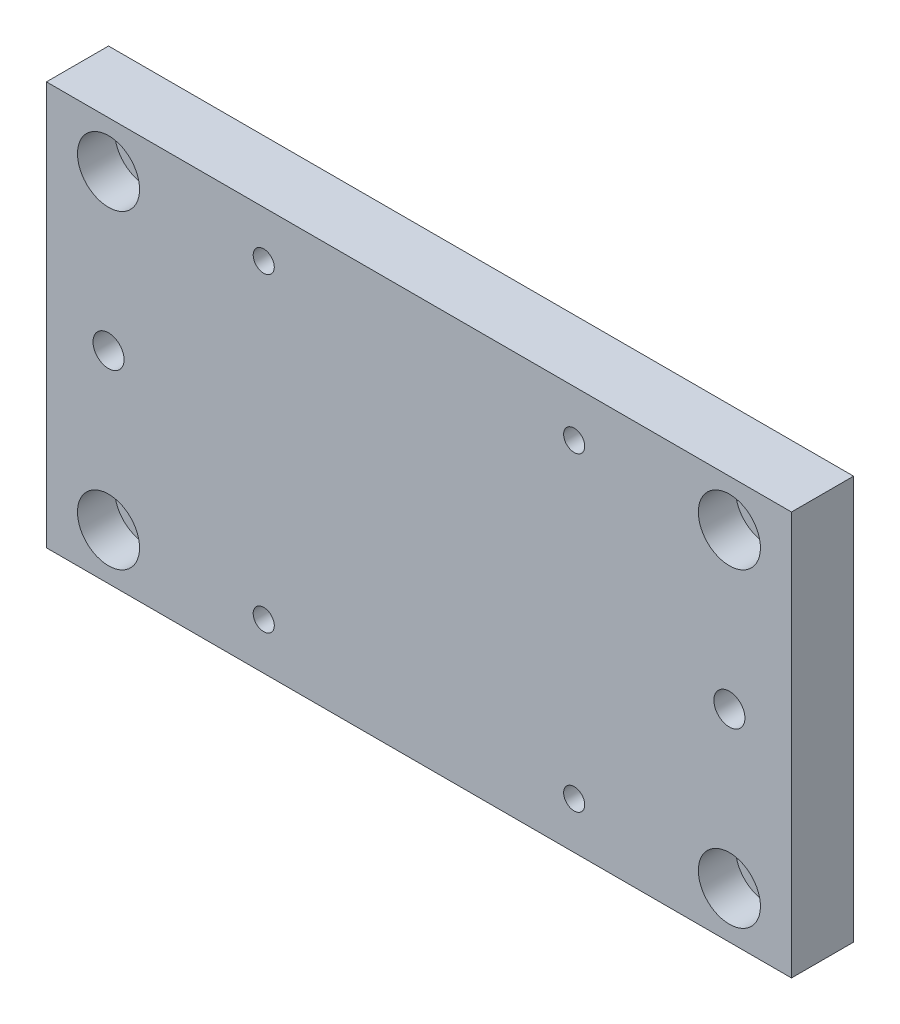
ISO-10303-21;
HEADER;
FILE_DESCRIPTION(('STEP AP214'),'2;1');
FILE_NAME('part.step','',(''),(''),'','','');
FILE_SCHEMA(('AUTOMOTIVE_DESIGN { 1 0 10303 214 1 1 1 1 }'));
ENDSEC;
DATA;
#1=APPLICATION_CONTEXT('core data for automotive mechanical design processes');
#2=APPLICATION_PROTOCOL_DEFINITION('international standard','automotive_design',2000,#1);
#3=PRODUCT_CONTEXT('',#1,'mechanical');
#4=PRODUCT('Part','Part','',(#3));
#5=PRODUCT_RELATED_PRODUCT_CATEGORY('part','',(#4));
#6=PRODUCT_DEFINITION_FORMATION('','',#4);
#7=PRODUCT_DEFINITION_CONTEXT('part definition',#1,'design');
#8=PRODUCT_DEFINITION('design','',#6,#7);
#9=PRODUCT_DEFINITION_SHAPE('','',#8);
#10=(LENGTH_UNIT() NAMED_UNIT(*) SI_UNIT(.MILLI.,.METRE.));
#11=(NAMED_UNIT(*) PLANE_ANGLE_UNIT() SI_UNIT($,.RADIAN.));
#12=(NAMED_UNIT(*) SI_UNIT($,.STERADIAN.) SOLID_ANGLE_UNIT());
#13=UNCERTAINTY_MEASURE_WITH_UNIT(LENGTH_MEASURE(1.E-05),#10,'distance_accuracy_value','');
#14=(GEOMETRIC_REPRESENTATION_CONTEXT(3) GLOBAL_UNCERTAINTY_ASSIGNED_CONTEXT((#13)) GLOBAL_UNIT_ASSIGNED_CONTEXT((#10,
#11,#12)) REPRESENTATION_CONTEXT('',''));
#15=CARTESIAN_POINT('',(0.,0.,0.));
#16=DIRECTION('',(0.,0.,1.));
#17=DIRECTION('',(1.,0.,0.));
#18=AXIS2_PLACEMENT_3D('',#15,#16,#17);
#19=CARTESIAN_POINT('',(9.99999999999999,7.5,10.));
#20=DIRECTION('',(0.,0.,-1.));
#21=DIRECTION('',(-1.,0.,0.));
#22=AXIS2_PLACEMENT_3D('',#19,#20,#21);
#23=CYLINDRICAL_SURFACE('',#22,3.04999999999999);
#24=CARTESIAN_POINT('',(9.99999999999999,7.5,0.));
#25=DIRECTION('',(0.,0.,1.));
#26=DIRECTION('',(-1.,0.,0.));
#27=AXIS2_PLACEMENT_3D('',#24,#25,#26);
#28=CIRCLE('',#27,3.04999999999999);
#29=CARTESIAN_POINT('',(6.95,7.5,0.));
#30=VERTEX_POINT('',#29);
#31=EDGE_CURVE('E157',#30,#30,#28,.T.);
#32=ORIENTED_EDGE('',*,*,#31,.F.);
#33=EDGE_LOOP('',(#32));
#34=FACE_BOUND('',#33,.T.);
#35=CARTESIAN_POINT('',(9.99999999999999,7.5,4.));
#36=DIRECTION('',(0.,0.,1.));
#37=DIRECTION('',(1.,0.,0.));
#38=AXIS2_PLACEMENT_3D('',#35,#36,#37);
#39=CIRCLE('',#38,3.04999999999999);
#40=CARTESIAN_POINT('',(13.05,7.5,4.));
#41=VERTEX_POINT('',#40);
#42=EDGE_CURVE('E36',#41,#41,#39,.T.);
#43=ORIENTED_EDGE('',*,*,#42,.T.);
#44=EDGE_LOOP('',(#43));
#45=FACE_BOUND('',#44,.T.);
#46=ADVANCED_FACE('F32',(#34,#45),#23,.F.);
#47=CARTESIAN_POINT('',(9.99999999999999,57.5,10.));
#48=DIRECTION('',(0.,0.,-1.));
#49=DIRECTION('',(-1.,0.,0.));
#50=AXIS2_PLACEMENT_3D('',#47,#48,#49);
#51=CYLINDRICAL_SURFACE('',#50,3.04999999999999);
#52=CARTESIAN_POINT('',(9.99999999999999,57.5,0.));
#53=DIRECTION('',(0.,0.,1.));
#54=DIRECTION('',(1.,0.,0.));
#55=AXIS2_PLACEMENT_3D('',#52,#53,#54);
#56=CIRCLE('',#55,3.04999999999999);
#57=CARTESIAN_POINT('',(13.05,57.5,0.));
#58=VERTEX_POINT('',#57);
#59=EDGE_CURVE('E152',#58,#58,#56,.T.);
#60=ORIENTED_EDGE('',*,*,#59,.F.);
#61=EDGE_LOOP('',(#60));
#62=FACE_BOUND('',#61,.T.);
#63=CARTESIAN_POINT('',(9.99999999999999,57.5,4.));
#64=DIRECTION('',(0.,0.,1.));
#65=DIRECTION('',(1.,0.,0.));
#66=AXIS2_PLACEMENT_3D('',#63,#64,#65);
#67=CIRCLE('',#66,3.04999999999999);
#68=CARTESIAN_POINT('',(13.05,57.5,4.));
#69=VERTEX_POINT('',#68);
#70=EDGE_CURVE('E118',#69,#69,#67,.T.);
#71=ORIENTED_EDGE('',*,*,#70,.T.);
#72=EDGE_LOOP('',(#71));
#73=FACE_BOUND('',#72,.T.);
#74=ADVANCED_FACE('F209',(#62,#73),#51,.F.);
#75=CARTESIAN_POINT('',(110.,57.5,10.));
#76=DIRECTION('',(0.,0.,-1.));
#77=DIRECTION('',(-1.,0.,0.));
#78=AXIS2_PLACEMENT_3D('',#75,#76,#77);
#79=CYLINDRICAL_SURFACE('',#78,3.04999999999999);
#80=CARTESIAN_POINT('',(110.,57.5,0.));
#81=DIRECTION('',(0.,0.,1.));
#82=DIRECTION('',(-1.,0.,0.));
#83=AXIS2_PLACEMENT_3D('',#80,#81,#82);
#84=CIRCLE('',#83,3.04999999999999);
#85=CARTESIAN_POINT('',(106.95,57.5,0.));
#86=VERTEX_POINT('',#85);
#87=EDGE_CURVE('E160',#86,#86,#84,.T.);
#88=ORIENTED_EDGE('',*,*,#87,.F.);
#89=EDGE_LOOP('',(#88));
#90=FACE_BOUND('',#89,.T.);
#91=CARTESIAN_POINT('',(110.,57.5,4.));
#92=DIRECTION('',(0.,0.,1.));
#93=DIRECTION('',(1.,0.,0.));
#94=AXIS2_PLACEMENT_3D('',#91,#92,#93);
#95=CIRCLE('',#94,3.04999999999999);
#96=CARTESIAN_POINT('',(113.05,57.5,4.));
#97=VERTEX_POINT('',#96);
#98=EDGE_CURVE('E114',#97,#97,#95,.T.);
#99=ORIENTED_EDGE('',*,*,#98,.T.);
#100=EDGE_LOOP('',(#99));
#101=FACE_BOUND('',#100,.T.);
#102=ADVANCED_FACE('F215',(#90,#101),#79,.F.);
#103=CARTESIAN_POINT('',(110.,7.5,10.));
#104=DIRECTION('',(0.,0.,-1.));
#105=DIRECTION('',(-1.,0.,0.));
#106=AXIS2_PLACEMENT_3D('',#103,#104,#105);
#107=CYLINDRICAL_SURFACE('',#106,3.04999999999999);
#108=CARTESIAN_POINT('',(110.,7.5,0.));
#109=DIRECTION('',(0.,0.,1.));
#110=DIRECTION('',(1.,0.,0.));
#111=AXIS2_PLACEMENT_3D('',#108,#109,#110);
#112=CIRCLE('',#111,3.04999999999999);
#113=CARTESIAN_POINT('',(113.05,7.5,0.));
#114=VERTEX_POINT('',#113);
#115=EDGE_CURVE('E163',#114,#114,#112,.T.);
#116=ORIENTED_EDGE('',*,*,#115,.F.);
#117=EDGE_LOOP('',(#116));
#118=FACE_BOUND('',#117,.T.);
#119=CARTESIAN_POINT('',(110.,7.5,4.));
#120=DIRECTION('',(0.,0.,1.));
#121=DIRECTION('',(1.,0.,0.));
#122=AXIS2_PLACEMENT_3D('',#119,#120,#121);
#123=CIRCLE('',#122,3.04999999999999);
#124=CARTESIAN_POINT('',(113.05,7.5,4.));
#125=VERTEX_POINT('',#124);
#126=EDGE_CURVE('E109',#125,#125,#123,.T.);
#127=ORIENTED_EDGE('',*,*,#126,.T.);
#128=EDGE_LOOP('',(#127));
#129=FACE_BOUND('',#128,.T.);
#130=ADVANCED_FACE('F224',(#118,#129),#107,.F.);
#131=CARTESIAN_POINT('',(0.,0.,10.));
#132=DIRECTION('',(0.,0.,-1.));
#133=DIRECTION('',(-1.,0.,0.));
#134=AXIS2_PLACEMENT_3D('',#131,#132,#133);
#135=PLANE('',#134);
#136=CARTESIAN_POINT('',(9.99999999999999,7.5,10.));
#137=DIRECTION('',(0.,0.,1.));
#138=DIRECTION('',(1.,0.,0.));
#139=AXIS2_PLACEMENT_3D('',#136,#137,#138);
#140=CIRCLE('',#139,5.);
#141=CARTESIAN_POINT('',(15.,7.5,10.));
#142=VERTEX_POINT('',#141);
#143=EDGE_CURVE('E134',#142,#142,#140,.T.);
#144=ORIENTED_EDGE('',*,*,#143,.F.);
#145=EDGE_LOOP('',(#144));
#146=FACE_BOUND('',#145,.T.);
#147=CARTESIAN_POINT('',(9.99999999999999,57.5,10.));
#148=DIRECTION('',(0.,0.,1.));
#149=DIRECTION('',(1.,0.,0.));
#150=AXIS2_PLACEMENT_3D('',#147,#148,#149);
#151=CIRCLE('',#150,5.);
#152=CARTESIAN_POINT('',(15.,57.5,10.));
#153=VERTEX_POINT('',#152);
#154=EDGE_CURVE('E127',#153,#153,#151,.T.);
#155=ORIENTED_EDGE('',*,*,#154,.F.);
#156=EDGE_LOOP('',(#155));
#157=FACE_BOUND('',#156,.T.);
#158=CARTESIAN_POINT('',(110.,57.5,10.));
#159=DIRECTION('',(0.,0.,1.));
#160=DIRECTION('',(1.,0.,0.));
#161=AXIS2_PLACEMENT_3D('',#158,#159,#160);
#162=CIRCLE('',#161,5.00000000000001);
#163=CARTESIAN_POINT('',(115.,57.5,10.));
#164=VERTEX_POINT('',#163);
#165=EDGE_CURVE('E120',#164,#164,#162,.T.);
#166=ORIENTED_EDGE('',*,*,#165,.F.);
#167=EDGE_LOOP('',(#166));
#168=FACE_BOUND('',#167,.T.);
#169=CARTESIAN_POINT('',(110.,7.5,10.));
#170=DIRECTION('',(0.,0.,1.));
#171=DIRECTION('',(1.,0.,0.));
#172=AXIS2_PLACEMENT_3D('',#169,#170,#171);
#173=CIRCLE('',#172,5.);
#174=CARTESIAN_POINT('',(115.,7.5,10.));
#175=VERTEX_POINT('',#174);
#176=EDGE_CURVE('E116',#175,#175,#173,.T.);
#177=ORIENTED_EDGE('',*,*,#176,.F.);
#178=EDGE_LOOP('',(#177));
#179=FACE_BOUND('',#178,.T.);
#180=CARTESIAN_POINT('',(110.,32.5,10.));
#181=DIRECTION('',(0.,0.,1.));
#182=DIRECTION('',(1.,0.,0.));
#183=AXIS2_PLACEMENT_3D('',#180,#181,#182);
#184=CIRCLE('',#183,2.5);
#185=CARTESIAN_POINT('',(112.5,32.5,10.));
#186=VERTEX_POINT('',#185);
#187=EDGE_CURVE('E149',#186,#186,#184,.T.);
#188=ORIENTED_EDGE('',*,*,#187,.F.);
#189=EDGE_LOOP('',(#188));
#190=FACE_BOUND('',#189,.T.);
#191=CARTESIAN_POINT('',(35.,7.5,10.));
#192=DIRECTION('',(0.,0.,1.));
#193=DIRECTION('',(-1.,0.,0.));
#194=AXIS2_PLACEMENT_3D('',#191,#192,#193);
#195=CIRCLE('',#194,1.7);
#196=CARTESIAN_POINT('',(33.3,7.5,10.));
#197=VERTEX_POINT('',#196);
#198=EDGE_CURVE('E173',#197,#197,#195,.T.);
#199=ORIENTED_EDGE('',*,*,#198,.F.);
#200=EDGE_LOOP('',(#199));
#201=FACE_BOUND('',#200,.T.);
#202=CARTESIAN_POINT('',(85.,7.5,10.));
#203=DIRECTION('',(0.,0.,1.));
#204=DIRECTION('',(1.,0.,0.));
#205=AXIS2_PLACEMENT_3D('',#202,#203,#204);
#206=CIRCLE('',#205,1.7);
#207=CARTESIAN_POINT('',(86.7,7.5,10.));
#208=VERTEX_POINT('',#207);
#209=EDGE_CURVE('E103',#208,#208,#206,.T.);
#210=ORIENTED_EDGE('',*,*,#209,.F.);
#211=EDGE_LOOP('',(#210));
#212=FACE_BOUND('',#211,.T.);
#213=DIRECTION('',(0.,-1.,0.));
#214=VECTOR('',#213,1.);
#215=CARTESIAN_POINT('',(0.,0.,10.));
#216=LINE('',#215,#214);
#217=CARTESIAN_POINT('',(0.,65.,10.));
#218=VERTEX_POINT('',#217);
#219=CARTESIAN_POINT('',(0.,0.,10.));
#220=VERTEX_POINT('',#219);
#221=EDGE_CURVE('E87',#218,#220,#216,.T.);
#222=ORIENTED_EDGE('',*,*,#221,.T.);
#223=DIRECTION('',(1.,0.,0.));
#224=VECTOR('',#223,1.);
#225=CARTESIAN_POINT('',(0.,0.,10.));
#226=LINE('',#225,#224);
#227=CARTESIAN_POINT('',(120.,0.,10.));
#228=VERTEX_POINT('',#227);
#229=EDGE_CURVE('E81',#220,#228,#226,.T.);
#230=ORIENTED_EDGE('',*,*,#229,.T.);
#231=DIRECTION('',(0.,1.,0.));
#232=VECTOR('',#231,1.);
#233=CARTESIAN_POINT('',(120.,0.,10.));
#234=LINE('',#233,#232);
#235=CARTESIAN_POINT('',(120.,65.,10.));
#236=VERTEX_POINT('',#235);
#237=EDGE_CURVE('E85',#228,#236,#234,.T.);
#238=ORIENTED_EDGE('',*,*,#237,.T.);
#239=DIRECTION('',(-1.,0.,0.));
#240=VECTOR('',#239,1.);
#241=CARTESIAN_POINT('',(0.,65.,10.));
#242=LINE('',#241,#240);
#243=EDGE_CURVE('E51',#236,#218,#242,.T.);
#244=ORIENTED_EDGE('',*,*,#243,.T.);
#245=EDGE_LOOP('',(#222,#230,#238,#244));
#246=FACE_BOUND('',#245,.T.);
#247=CARTESIAN_POINT('',(85.,57.5,10.));
#248=DIRECTION('',(0.,0.,1.));
#249=DIRECTION('',(-1.,0.,0.));
#250=AXIS2_PLACEMENT_3D('',#247,#248,#249);
#251=CIRCLE('',#250,1.7);
#252=CARTESIAN_POINT('',(83.3,57.5,10.));
#253=VERTEX_POINT('',#252);
#254=EDGE_CURVE('E179',#253,#253,#251,.T.);
#255=ORIENTED_EDGE('',*,*,#254,.F.);
#256=EDGE_LOOP('',(#255));
#257=FACE_BOUND('',#256,.T.);
#258=CARTESIAN_POINT('',(35.,57.5,10.));
#259=DIRECTION('',(0.,0.,1.));
#260=DIRECTION('',(1.,0.,0.));
#261=AXIS2_PLACEMENT_3D('',#258,#259,#260);
#262=CIRCLE('',#261,1.7);
#263=CARTESIAN_POINT('',(36.7,57.5,10.));
#264=VERTEX_POINT('',#263);
#265=EDGE_CURVE('E167',#264,#264,#262,.T.);
#266=ORIENTED_EDGE('',*,*,#265,.F.);
#267=EDGE_LOOP('',(#266));
#268=FACE_BOUND('',#267,.T.);
#269=CARTESIAN_POINT('',(9.99999999999998,32.5,10.));
#270=DIRECTION('',(0.,0.,1.));
#271=DIRECTION('',(-1.,0.,0.));
#272=AXIS2_PLACEMENT_3D('',#269,#270,#271);
#273=CIRCLE('',#272,2.5);
#274=CARTESIAN_POINT('',(7.49999999999999,32.5,10.));
#275=VERTEX_POINT('',#274);
#276=EDGE_CURVE('E143',#275,#275,#273,.T.);
#277=ORIENTED_EDGE('',*,*,#276,.F.);
#278=EDGE_LOOP('',(#277));
#279=FACE_BOUND('',#278,.T.);
#280=ADVANCED_FACE('F82',(#146,#157,#168,#179,#190,#201,#212,#246,#257,#268,#279),#135,.F.);
#281=CARTESIAN_POINT('',(0.,0.,0.));
#282=DIRECTION('',(0.,0.,-1.));
#283=DIRECTION('',(-1.,0.,0.));
#284=AXIS2_PLACEMENT_3D('',#281,#282,#283);
#285=PLANE('',#284);
#286=CARTESIAN_POINT('',(110.,32.5,0.));
#287=DIRECTION('',(0.,0.,1.));
#288=DIRECTION('',(1.,0.,0.));
#289=AXIS2_PLACEMENT_3D('',#286,#287,#288);
#290=CIRCLE('',#289,2.5);
#291=CARTESIAN_POINT('',(112.5,32.5,0.));
#292=VERTEX_POINT('',#291);
#293=EDGE_CURVE('E146',#292,#292,#290,.T.);
#294=ORIENTED_EDGE('',*,*,#293,.T.);
#295=EDGE_LOOP('',(#294));
#296=FACE_BOUND('',#295,.T.);
#297=ORIENTED_EDGE('',*,*,#31,.T.);
#298=EDGE_LOOP('',(#297));
#299=FACE_BOUND('',#298,.T.);
#300=ORIENTED_EDGE('',*,*,#115,.T.);
#301=EDGE_LOOP('',(#300));
#302=FACE_BOUND('',#301,.T.);
#303=CARTESIAN_POINT('',(35.,7.5,0.));
#304=DIRECTION('',(0.,0.,1.));
#305=DIRECTION('',(-1.,0.,0.));
#306=AXIS2_PLACEMENT_3D('',#303,#304,#305);
#307=CIRCLE('',#306,1.7);
#308=CARTESIAN_POINT('',(33.3,7.5,0.));
#309=VERTEX_POINT('',#308);
#310=EDGE_CURVE('E170',#309,#309,#307,.T.);
#311=ORIENTED_EDGE('',*,*,#310,.T.);
#312=EDGE_LOOP('',(#311));
#313=FACE_BOUND('',#312,.T.);
#314=CARTESIAN_POINT('',(85.,7.5,0.));
#315=DIRECTION('',(0.,0.,1.));
#316=DIRECTION('',(1.,0.,0.));
#317=AXIS2_PLACEMENT_3D('',#314,#315,#316);
#318=CIRCLE('',#317,1.7);
#319=CARTESIAN_POINT('',(86.7,7.5,0.));
#320=VERTEX_POINT('',#319);
#321=EDGE_CURVE('E182',#320,#320,#318,.T.);
#322=ORIENTED_EDGE('',*,*,#321,.T.);
#323=EDGE_LOOP('',(#322));
#324=FACE_BOUND('',#323,.T.);
#325=DIRECTION('',(0.,-1.,0.));
#326=VECTOR('',#325,1.);
#327=CARTESIAN_POINT('',(0.,0.,0.));
#328=LINE('',#327,#326);
#329=CARTESIAN_POINT('',(0.,65.,0.));
#330=VERTEX_POINT('',#329);
#331=CARTESIAN_POINT('',(0.,0.,0.));
#332=VERTEX_POINT('',#331);
#333=EDGE_CURVE('E100',#330,#332,#328,.T.);
#334=ORIENTED_EDGE('',*,*,#333,.F.);
#335=DIRECTION('',(-1.,0.,0.));
#336=VECTOR('',#335,1.);
#337=CARTESIAN_POINT('',(0.,65.,0.));
#338=LINE('',#337,#336);
#339=CARTESIAN_POINT('',(120.,65.,0.));
#340=VERTEX_POINT('',#339);
#341=EDGE_CURVE('E74',#340,#330,#338,.T.);
#342=ORIENTED_EDGE('',*,*,#341,.F.);
#343=DIRECTION('',(0.,1.,0.));
#344=VECTOR('',#343,1.);
#345=CARTESIAN_POINT('',(120.,0.,0.));
#346=LINE('',#345,#344);
#347=CARTESIAN_POINT('',(120.,0.,0.));
#348=VERTEX_POINT('',#347);
#349=EDGE_CURVE('E68',#348,#340,#346,.T.);
#350=ORIENTED_EDGE('',*,*,#349,.F.);
#351=DIRECTION('',(1.,0.,0.));
#352=VECTOR('',#351,1.);
#353=CARTESIAN_POINT('',(0.,0.,0.));
#354=LINE('',#353,#352);
#355=EDGE_CURVE('E91',#332,#348,#354,.T.);
#356=ORIENTED_EDGE('',*,*,#355,.F.);
#357=EDGE_LOOP('',(#334,#342,#350,#356));
#358=FACE_BOUND('',#357,.T.);
#359=CARTESIAN_POINT('',(85.,57.5,0.));
#360=DIRECTION('',(0.,0.,1.));
#361=DIRECTION('',(-1.,0.,0.));
#362=AXIS2_PLACEMENT_3D('',#359,#360,#361);
#363=CIRCLE('',#362,1.7);
#364=CARTESIAN_POINT('',(83.3,57.5,0.));
#365=VERTEX_POINT('',#364);
#366=EDGE_CURVE('E176',#365,#365,#363,.T.);
#367=ORIENTED_EDGE('',*,*,#366,.T.);
#368=EDGE_LOOP('',(#367));
#369=FACE_BOUND('',#368,.T.);
#370=CARTESIAN_POINT('',(35.,57.5,0.));
#371=DIRECTION('',(0.,0.,1.));
#372=DIRECTION('',(1.,0.,0.));
#373=AXIS2_PLACEMENT_3D('',#370,#371,#372);
#374=CIRCLE('',#373,1.7);
#375=CARTESIAN_POINT('',(36.7,57.5,0.));
#376=VERTEX_POINT('',#375);
#377=EDGE_CURVE('E166',#376,#376,#374,.T.);
#378=ORIENTED_EDGE('',*,*,#377,.T.);
#379=EDGE_LOOP('',(#378));
#380=FACE_BOUND('',#379,.T.);
#381=ORIENTED_EDGE('',*,*,#87,.T.);
#382=EDGE_LOOP('',(#381));
#383=FACE_BOUND('',#382,.T.);
#384=ORIENTED_EDGE('',*,*,#59,.T.);
#385=EDGE_LOOP('',(#384));
#386=FACE_BOUND('',#385,.T.);
#387=CARTESIAN_POINT('',(9.99999999999998,32.5,0.));
#388=DIRECTION('',(0.,0.,1.));
#389=DIRECTION('',(-1.,0.,0.));
#390=AXIS2_PLACEMENT_3D('',#387,#388,#389);
#391=CIRCLE('',#390,2.5);
#392=CARTESIAN_POINT('',(7.49999999999999,32.5,0.));
#393=VERTEX_POINT('',#392);
#394=EDGE_CURVE('E112',#393,#393,#391,.T.);
#395=ORIENTED_EDGE('',*,*,#394,.T.);
#396=EDGE_LOOP('',(#395));
#397=FACE_BOUND('',#396,.T.);
#398=ADVANCED_FACE('F190',(#296,#299,#302,#313,#324,#358,#369,#380,#383,#386,#397),#285,.T.);
#399=CARTESIAN_POINT('',(0.,0.,10.));
#400=DIRECTION('',(1.,0.,0.));
#401=DIRECTION('',(0.,0.,-1.));
#402=AXIS2_PLACEMENT_3D('',#399,#400,#401);
#403=PLANE('',#402);
#404=ORIENTED_EDGE('',*,*,#333,.T.);
#405=DIRECTION('',(0.,0.,-1.));
#406=VECTOR('',#405,1.);
#407=CARTESIAN_POINT('',(0.,0.,10.));
#408=LINE('',#407,#406);
#409=EDGE_CURVE('E11',#220,#332,#408,.T.);
#410=ORIENTED_EDGE('',*,*,#409,.F.);
#411=ORIENTED_EDGE('',*,*,#221,.F.);
#412=DIRECTION('',(0.,0.,-1.));
#413=VECTOR('',#412,1.);
#414=CARTESIAN_POINT('',(0.,65.,10.));
#415=LINE('',#414,#413);
#416=EDGE_CURVE('E96',#218,#330,#415,.T.);
#417=ORIENTED_EDGE('',*,*,#416,.T.);
#418=EDGE_LOOP('',(#404,#410,#411,#417));
#419=FACE_BOUND('',#418,.T.);
#420=ADVANCED_FACE('F34',(#419),#403,.F.);
#421=CARTESIAN_POINT('',(0.,0.,10.));
#422=DIRECTION('',(0.,1.,0.));
#423=DIRECTION('',(0.,0.,1.));
#424=AXIS2_PLACEMENT_3D('',#421,#422,#423);
#425=PLANE('',#424);
#426=ORIENTED_EDGE('',*,*,#355,.T.);
#427=DIRECTION('',(0.,0.,-1.));
#428=VECTOR('',#427,1.);
#429=CARTESIAN_POINT('',(120.,0.,10.));
#430=LINE('',#429,#428);
#431=EDGE_CURVE('E42',#228,#348,#430,.T.);
#432=ORIENTED_EDGE('',*,*,#431,.F.);
#433=ORIENTED_EDGE('',*,*,#229,.F.);
#434=ORIENTED_EDGE('',*,*,#409,.T.);
#435=EDGE_LOOP('',(#426,#432,#433,#434));
#436=FACE_BOUND('',#435,.T.);
#437=ADVANCED_FACE('F90',(#436),#425,.F.);
#438=CARTESIAN_POINT('',(120.,0.,10.));
#439=DIRECTION('',(-1.,0.,0.));
#440=DIRECTION('',(0.,0.,1.));
#441=AXIS2_PLACEMENT_3D('',#438,#439,#440);
#442=PLANE('',#441);
#443=ORIENTED_EDGE('',*,*,#349,.T.);
#444=DIRECTION('',(0.,0.,-1.));
#445=VECTOR('',#444,1.);
#446=CARTESIAN_POINT('',(120.,65.,10.));
#447=LINE('',#446,#445);
#448=EDGE_CURVE('E92',#236,#340,#447,.T.);
#449=ORIENTED_EDGE('',*,*,#448,.F.);
#450=ORIENTED_EDGE('',*,*,#237,.F.);
#451=ORIENTED_EDGE('',*,*,#431,.T.);
#452=EDGE_LOOP('',(#443,#449,#450,#451));
#453=FACE_BOUND('',#452,.T.);
#454=ADVANCED_FACE('F94',(#453),#442,.F.);
#455=CARTESIAN_POINT('',(0.,65.,10.));
#456=DIRECTION('',(0.,-1.,0.));
#457=DIRECTION('',(0.,0.,-1.));
#458=AXIS2_PLACEMENT_3D('',#455,#456,#457);
#459=PLANE('',#458);
#460=ORIENTED_EDGE('',*,*,#341,.T.);
#461=ORIENTED_EDGE('',*,*,#416,.F.);
#462=ORIENTED_EDGE('',*,*,#243,.F.);
#463=ORIENTED_EDGE('',*,*,#448,.T.);
#464=EDGE_LOOP('',(#460,#461,#462,#463));
#465=FACE_BOUND('',#464,.T.);
#466=ADVANCED_FACE('F196',(#465),#459,.F.);
#467=CARTESIAN_POINT('',(85.,7.5,10.));
#468=DIRECTION('',(0.,0.,-1.));
#469=DIRECTION('',(-1.,0.,0.));
#470=AXIS2_PLACEMENT_3D('',#467,#468,#469);
#471=CYLINDRICAL_SURFACE('',#470,1.7);
#472=ORIENTED_EDGE('',*,*,#209,.T.);
#473=EDGE_LOOP('',(#472));
#474=FACE_BOUND('',#473,.T.);
#475=ORIENTED_EDGE('',*,*,#321,.F.);
#476=EDGE_LOOP('',(#475));
#477=FACE_BOUND('',#476,.T.);
#478=ADVANCED_FACE('F193',(#474,#477),#471,.F.);
#479=CARTESIAN_POINT('',(85.,57.5,10.));
#480=DIRECTION('',(0.,0.,-1.));
#481=DIRECTION('',(-1.,0.,0.));
#482=AXIS2_PLACEMENT_3D('',#479,#480,#481);
#483=CYLINDRICAL_SURFACE('',#482,1.7);
#484=ORIENTED_EDGE('',*,*,#254,.T.);
#485=EDGE_LOOP('',(#484));
#486=FACE_BOUND('',#485,.T.);
#487=ORIENTED_EDGE('',*,*,#366,.F.);
#488=EDGE_LOOP('',(#487));
#489=FACE_BOUND('',#488,.T.);
#490=ADVANCED_FACE('F195',(#486,#489),#483,.F.);
#491=CARTESIAN_POINT('',(35.,7.5,10.));
#492=DIRECTION('',(0.,0.,-1.));
#493=DIRECTION('',(-1.,0.,0.));
#494=AXIS2_PLACEMENT_3D('',#491,#492,#493);
#495=CYLINDRICAL_SURFACE('',#494,1.7);
#496=ORIENTED_EDGE('',*,*,#198,.T.);
#497=EDGE_LOOP('',(#496));
#498=FACE_BOUND('',#497,.T.);
#499=ORIENTED_EDGE('',*,*,#310,.F.);
#500=EDGE_LOOP('',(#499));
#501=FACE_BOUND('',#500,.T.);
#502=ADVANCED_FACE('F203',(#498,#501),#495,.F.);
#503=CARTESIAN_POINT('',(35.,57.5,10.));
#504=DIRECTION('',(0.,0.,-1.));
#505=DIRECTION('',(-1.,0.,0.));
#506=AXIS2_PLACEMENT_3D('',#503,#504,#505);
#507=CYLINDRICAL_SURFACE('',#506,1.7);
#508=ORIENTED_EDGE('',*,*,#265,.T.);
#509=EDGE_LOOP('',(#508));
#510=FACE_BOUND('',#509,.T.);
#511=ORIENTED_EDGE('',*,*,#377,.F.);
#512=EDGE_LOOP('',(#511));
#513=FACE_BOUND('',#512,.T.);
#514=ADVANCED_FACE('F229',(#510,#513),#507,.F.);
#515=CARTESIAN_POINT('',(110.,32.5,10.));
#516=DIRECTION('',(0.,0.,-1.));
#517=DIRECTION('',(-1.,0.,0.));
#518=AXIS2_PLACEMENT_3D('',#515,#516,#517);
#519=CYLINDRICAL_SURFACE('',#518,2.5);
#520=ORIENTED_EDGE('',*,*,#187,.T.);
#521=EDGE_LOOP('',(#520));
#522=FACE_BOUND('',#521,.T.);
#523=ORIENTED_EDGE('',*,*,#293,.F.);
#524=EDGE_LOOP('',(#523));
#525=FACE_BOUND('',#524,.T.);
#526=ADVANCED_FACE('F232',(#522,#525),#519,.F.);
#527=CARTESIAN_POINT('',(9.99999999999998,32.5,10.));
#528=DIRECTION('',(0.,0.,-1.));
#529=DIRECTION('',(-1.,0.,0.));
#530=AXIS2_PLACEMENT_3D('',#527,#528,#529);
#531=CYLINDRICAL_SURFACE('',#530,2.5);
#532=ORIENTED_EDGE('',*,*,#276,.T.);
#533=EDGE_LOOP('',(#532));
#534=FACE_BOUND('',#533,.T.);
#535=ORIENTED_EDGE('',*,*,#394,.F.);
#536=EDGE_LOOP('',(#535));
#537=FACE_BOUND('',#536,.T.);
#538=ADVANCED_FACE('F296',(#534,#537),#531,.F.);
#539=CARTESIAN_POINT('',(110.,7.5,4.));
#540=DIRECTION('',(0.,0.,1.));
#541=DIRECTION('',(1.,0.,0.));
#542=AXIS2_PLACEMENT_3D('',#539,#540,#541);
#543=CYLINDRICAL_SURFACE('',#542,5.);
#544=CARTESIAN_POINT('',(110.,7.5,4.));
#545=DIRECTION('',(0.,0.,1.));
#546=DIRECTION('',(1.,0.,0.));
#547=AXIS2_PLACEMENT_3D('',#544,#545,#546);
#548=CIRCLE('',#547,5.);
#549=CARTESIAN_POINT('',(115.,7.5,4.));
#550=VERTEX_POINT('',#549);
#551=EDGE_CURVE('E113',#550,#550,#548,.T.);
#552=ORIENTED_EDGE('',*,*,#551,.F.);
#553=EDGE_LOOP('',(#552));
#554=FACE_BOUND('',#553,.T.);
#555=ORIENTED_EDGE('',*,*,#176,.T.);
#556=EDGE_LOOP('',(#555));
#557=FACE_BOUND('',#556,.T.);
#558=ADVANCED_FACE('F304',(#554,#557),#543,.F.);
#559=CARTESIAN_POINT('',(110.,7.5,4.));
#560=DIRECTION('',(0.,0.,1.));
#561=DIRECTION('',(1.,0.,0.));
#562=AXIS2_PLACEMENT_3D('',#559,#560,#561);
#563=PLANE('',#562);
#564=ORIENTED_EDGE('',*,*,#126,.F.);
#565=EDGE_LOOP('',(#564));
#566=FACE_BOUND('',#565,.T.);
#567=ORIENTED_EDGE('',*,*,#551,.T.);
#568=EDGE_LOOP('',(#567));
#569=FACE_BOUND('',#568,.T.);
#570=ADVANCED_FACE('F344',(#566,#569),#563,.T.);
#571=CARTESIAN_POINT('',(110.,57.5,4.));
#572=DIRECTION('',(0.,0.,1.));
#573=DIRECTION('',(1.,0.,0.));
#574=AXIS2_PLACEMENT_3D('',#571,#572,#573);
#575=CYLINDRICAL_SURFACE('',#574,5.00000000000001);
#576=CARTESIAN_POINT('',(110.,57.5,4.));
#577=DIRECTION('',(0.,0.,1.));
#578=DIRECTION('',(1.,0.,0.));
#579=AXIS2_PLACEMENT_3D('',#576,#577,#578);
#580=CIRCLE('',#579,5.00000000000001);
#581=CARTESIAN_POINT('',(115.,57.5,4.));
#582=VERTEX_POINT('',#581);
#583=EDGE_CURVE('E117',#582,#582,#580,.T.);
#584=ORIENTED_EDGE('',*,*,#583,.F.);
#585=EDGE_LOOP('',(#584));
#586=FACE_BOUND('',#585,.T.);
#587=ORIENTED_EDGE('',*,*,#165,.T.);
#588=EDGE_LOOP('',(#587));
#589=FACE_BOUND('',#588,.T.);
#590=ADVANCED_FACE('F354',(#586,#589),#575,.F.);
#591=CARTESIAN_POINT('',(110.,57.5,4.));
#592=DIRECTION('',(0.,0.,1.));
#593=DIRECTION('',(1.,0.,0.));
#594=AXIS2_PLACEMENT_3D('',#591,#592,#593);
#595=PLANE('',#594);
#596=ORIENTED_EDGE('',*,*,#98,.F.);
#597=EDGE_LOOP('',(#596));
#598=FACE_BOUND('',#597,.T.);
#599=ORIENTED_EDGE('',*,*,#583,.T.);
#600=EDGE_LOOP('',(#599));
#601=FACE_BOUND('',#600,.T.);
#602=ADVANCED_FACE('F364',(#598,#601),#595,.T.);
#603=CARTESIAN_POINT('',(9.99999999999999,57.5,4.));
#604=DIRECTION('',(0.,0.,1.));
#605=DIRECTION('',(1.,0.,0.));
#606=AXIS2_PLACEMENT_3D('',#603,#604,#605);
#607=CYLINDRICAL_SURFACE('',#606,5.);
#608=CARTESIAN_POINT('',(9.99999999999999,57.5,4.));
#609=DIRECTION('',(0.,0.,1.));
#610=DIRECTION('',(1.,0.,0.));
#611=AXIS2_PLACEMENT_3D('',#608,#609,#610);
#612=CIRCLE('',#611,5.);
#613=CARTESIAN_POINT('',(15.,57.5,4.));
#614=VERTEX_POINT('',#613);
#615=EDGE_CURVE('E121',#614,#614,#612,.T.);
#616=ORIENTED_EDGE('',*,*,#615,.F.);
#617=EDGE_LOOP('',(#616));
#618=FACE_BOUND('',#617,.T.);
#619=ORIENTED_EDGE('',*,*,#154,.T.);
#620=EDGE_LOOP('',(#619));
#621=FACE_BOUND('',#620,.T.);
#622=ADVANCED_FACE('F374',(#618,#621),#607,.F.);
#623=CARTESIAN_POINT('',(9.99999999999999,57.5,4.));
#624=DIRECTION('',(0.,0.,1.));
#625=DIRECTION('',(1.,0.,0.));
#626=AXIS2_PLACEMENT_3D('',#623,#624,#625);
#627=PLANE('',#626);
#628=ORIENTED_EDGE('',*,*,#70,.F.);
#629=EDGE_LOOP('',(#628));
#630=FACE_BOUND('',#629,.T.);
#631=ORIENTED_EDGE('',*,*,#615,.T.);
#632=EDGE_LOOP('',(#631));
#633=FACE_BOUND('',#632,.T.);
#634=ADVANCED_FACE('F384',(#630,#633),#627,.T.);
#635=CARTESIAN_POINT('',(9.99999999999999,7.5,4.));
#636=DIRECTION('',(0.,0.,1.));
#637=DIRECTION('',(1.,0.,0.));
#638=AXIS2_PLACEMENT_3D('',#635,#636,#637);
#639=CYLINDRICAL_SURFACE('',#638,5.);
#640=CARTESIAN_POINT('',(9.99999999999999,7.5,4.));
#641=DIRECTION('',(0.,0.,1.));
#642=DIRECTION('',(1.,0.,0.));
#643=AXIS2_PLACEMENT_3D('',#640,#641,#642);
#644=CIRCLE('',#643,5.);
#645=CARTESIAN_POINT('',(15.,7.5,4.));
#646=VERTEX_POINT('',#645);
#647=EDGE_CURVE('E423',#646,#646,#644,.T.);
#648=ORIENTED_EDGE('',*,*,#647,.F.);
#649=EDGE_LOOP('',(#648));
#650=FACE_BOUND('',#649,.T.);
#651=ORIENTED_EDGE('',*,*,#143,.T.);
#652=EDGE_LOOP('',(#651));
#653=FACE_BOUND('',#652,.T.);
#654=ADVANCED_FACE('F394',(#650,#653),#639,.F.);
#655=CARTESIAN_POINT('',(9.99999999999999,7.5,4.));
#656=DIRECTION('',(0.,0.,1.));
#657=DIRECTION('',(1.,0.,0.));
#658=AXIS2_PLACEMENT_3D('',#655,#656,#657);
#659=PLANE('',#658);
#660=ORIENTED_EDGE('',*,*,#42,.F.);
#661=EDGE_LOOP('',(#660));
#662=FACE_BOUND('',#661,.T.);
#663=ORIENTED_EDGE('',*,*,#647,.T.);
#664=EDGE_LOOP('',(#663));
#665=FACE_BOUND('',#664,.T.);
#666=ADVANCED_FACE('F404',(#662,#665),#659,.T.);
#667=CLOSED_SHELL('',(#46,#74,#102,#130,#280,#398,#420,#437,#454,#466,#478,#490,#502,#514,#526,
#538,#558,#570,#590,#602,#622,#634,#654,#666));
#668=MANIFOLD_SOLID_BREP('B2',#667);
#669=ADVANCED_BREP_SHAPE_REPRESENTATION('',(#18,#668),#14);
#670=SHAPE_DEFINITION_REPRESENTATION(#9,#669);
ENDSEC;
END-ISO-10303-21;
